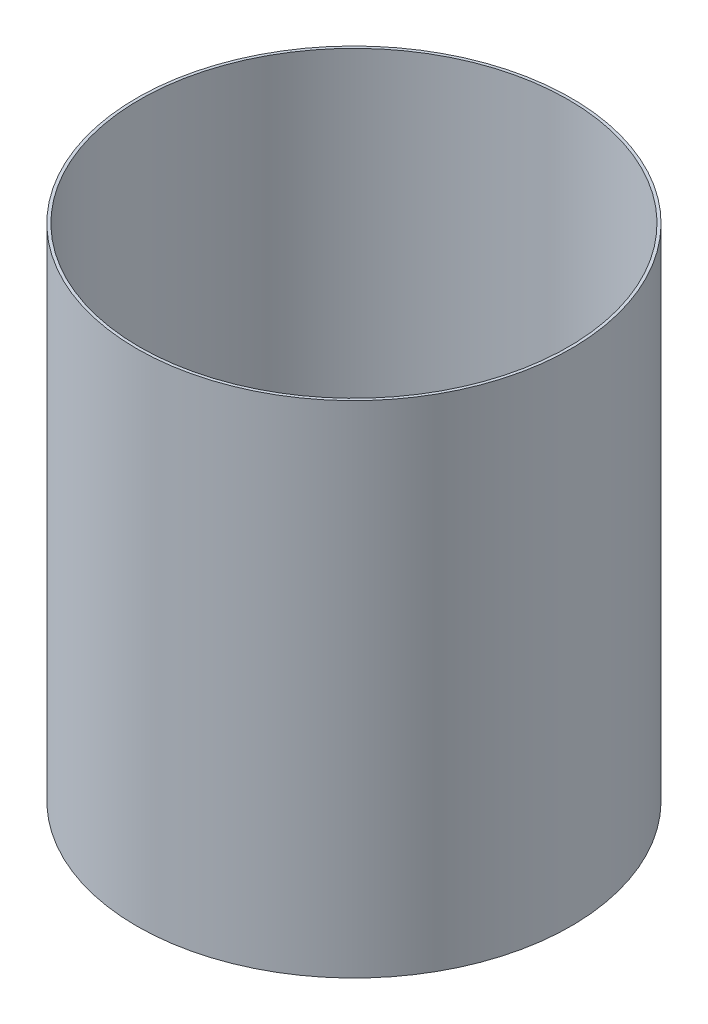
ISO-10303-21;
HEADER;
FILE_DESCRIPTION(('STEP AP214'),'2;1');
FILE_NAME('part.step','',(''),(''),'','','');
FILE_SCHEMA(('AUTOMOTIVE_DESIGN { 1 0 10303 214 1 1 1 1 }'));
ENDSEC;
DATA;
#1=APPLICATION_CONTEXT('core data for automotive mechanical design processes');
#2=APPLICATION_PROTOCOL_DEFINITION('international standard','automotive_design',2000,#1);
#3=PRODUCT_CONTEXT('',#1,'mechanical');
#4=PRODUCT('Part','Part','',(#3));
#5=PRODUCT_RELATED_PRODUCT_CATEGORY('part','',(#4));
#6=PRODUCT_DEFINITION_FORMATION('','',#4);
#7=PRODUCT_DEFINITION_CONTEXT('part definition',#1,'design');
#8=PRODUCT_DEFINITION('design','',#6,#7);
#9=PRODUCT_DEFINITION_SHAPE('','',#8);
#10=(LENGTH_UNIT() NAMED_UNIT(*) SI_UNIT(.MILLI.,.METRE.));
#11=(NAMED_UNIT(*) PLANE_ANGLE_UNIT() SI_UNIT($,.RADIAN.));
#12=(NAMED_UNIT(*) SI_UNIT($,.STERADIAN.) SOLID_ANGLE_UNIT());
#13=UNCERTAINTY_MEASURE_WITH_UNIT(LENGTH_MEASURE(1.E-05),#10,'distance_accuracy_value','');
#14=(GEOMETRIC_REPRESENTATION_CONTEXT(3) GLOBAL_UNCERTAINTY_ASSIGNED_CONTEXT((#13)) GLOBAL_UNIT_ASSIGNED_CONTEXT((#10,
#11,#12)) REPRESENTATION_CONTEXT('',''));
#15=CARTESIAN_POINT('',(0.,0.,0.));
#16=DIRECTION('',(0.,0.,1.));
#17=DIRECTION('',(1.,0.,0.));
#18=AXIS2_PLACEMENT_3D('',#15,#16,#17);
#19=CARTESIAN_POINT('',(0.,55.,0.));
#20=DIRECTION('',(0.,1.,0.));
#21=DIRECTION('',(0.,0.,1.));
#22=AXIS2_PLACEMENT_3D('',#19,#20,#21);
#23=CYLINDRICAL_SURFACE('',#22,76.2);
#24=CARTESIAN_POINT('',(0.,-91.6507735583685,0.));
#25=DIRECTION('',(0.,1.,0.));
#26=DIRECTION('',(0.,0.,1.));
#27=AXIS2_PLACEMENT_3D('',#24,#25,#26);
#28=CIRCLE('',#27,76.2);
#29=CARTESIAN_POINT('',(0.,-91.6507735583685,76.2));
#30=VERTEX_POINT('',#29);
#31=EDGE_CURVE('E10',#30,#30,#28,.T.);
#32=ORIENTED_EDGE('',*,*,#31,.F.);
#33=EDGE_LOOP('',(#32));
#34=FACE_BOUND('',#33,.T.);
#35=CARTESIAN_POINT('',(0.,86.1492264416315,0.));
#36=DIRECTION('',(0.,1.,0.));
#37=DIRECTION('',(0.,0.,1.));
#38=AXIS2_PLACEMENT_3D('',#35,#36,#37);
#39=CIRCLE('',#38,76.2);
#40=CARTESIAN_POINT('',(0.,86.1492264416315,76.2));
#41=VERTEX_POINT('',#40);
#42=EDGE_CURVE('E47',#41,#41,#39,.T.);
#43=ORIENTED_EDGE('',*,*,#42,.T.);
#44=EDGE_LOOP('',(#43));
#45=FACE_BOUND('',#44,.T.);
#46=ADVANCED_FACE('F33',(#34,#45),#23,.F.);
#47=CARTESIAN_POINT('',(76.2,-91.6507735583685,0.));
#48=DIRECTION('',(0.,1.,0.));
#49=DIRECTION('',(0.,0.,1.));
#50=AXIS2_PLACEMENT_3D('',#47,#48,#49);
#51=PLANE('',#50);
#52=CARTESIAN_POINT('',(0.,-91.6507735583685,0.));
#53=DIRECTION('',(0.,1.,0.));
#54=DIRECTION('',(0.,0.,1.));
#55=AXIS2_PLACEMENT_3D('',#52,#53,#54);
#56=CIRCLE('',#55,77.216);
#57=CARTESIAN_POINT('',(0.,-91.6507735583685,77.216));
#58=VERTEX_POINT('',#57);
#59=EDGE_CURVE('E39',#58,#58,#56,.T.);
#60=ORIENTED_EDGE('',*,*,#59,.F.);
#61=EDGE_LOOP('',(#60));
#62=FACE_BOUND('',#61,.T.);
#63=ORIENTED_EDGE('',*,*,#31,.T.);
#64=EDGE_LOOP('',(#63));
#65=FACE_BOUND('',#64,.T.);
#66=ADVANCED_FACE('F62',(#62,#65),#51,.F.);
#67=CARTESIAN_POINT('',(0.,55.,0.));
#68=DIRECTION('',(0.,1.,0.));
#69=DIRECTION('',(0.,0.,1.));
#70=AXIS2_PLACEMENT_3D('',#67,#68,#69);
#71=CYLINDRICAL_SURFACE('',#70,77.216);
#72=CARTESIAN_POINT('',(0.,86.1492264416315,0.));
#73=DIRECTION('',(0.,1.,0.));
#74=DIRECTION('',(0.,0.,1.));
#75=AXIS2_PLACEMENT_3D('',#72,#73,#74);
#76=CIRCLE('',#75,77.216);
#77=CARTESIAN_POINT('',(0.,86.1492264416315,77.216));
#78=VERTEX_POINT('',#77);
#79=EDGE_CURVE('E43',#78,#78,#76,.T.);
#80=ORIENTED_EDGE('',*,*,#79,.F.);
#81=EDGE_LOOP('',(#80));
#82=FACE_BOUND('',#81,.T.);
#83=ORIENTED_EDGE('',*,*,#59,.T.);
#84=EDGE_LOOP('',(#83));
#85=FACE_BOUND('',#84,.T.);
#86=ADVANCED_FACE('F57',(#82,#85),#71,.T.);
#87=CARTESIAN_POINT('',(76.2,86.1492264416315,0.));
#88=DIRECTION('',(0.,-1.,0.));
#89=DIRECTION('',(0.,0.,-1.));
#90=AXIS2_PLACEMENT_3D('',#87,#88,#89);
#91=PLANE('',#90);
#92=ORIENTED_EDGE('',*,*,#42,.F.);
#93=EDGE_LOOP('',(#92));
#94=FACE_BOUND('',#93,.T.);
#95=ORIENTED_EDGE('',*,*,#79,.T.);
#96=EDGE_LOOP('',(#95));
#97=FACE_BOUND('',#96,.T.);
#98=ADVANCED_FACE('F54',(#94,#97),#91,.F.);
#99=CLOSED_SHELL('',(#46,#66,#86,#98));
#100=MANIFOLD_SOLID_BREP('B2',#99);
#101=ADVANCED_BREP_SHAPE_REPRESENTATION('',(#18,#100),#14);
#102=SHAPE_DEFINITION_REPRESENTATION(#9,#101);
ENDSEC;
END-ISO-10303-21;
